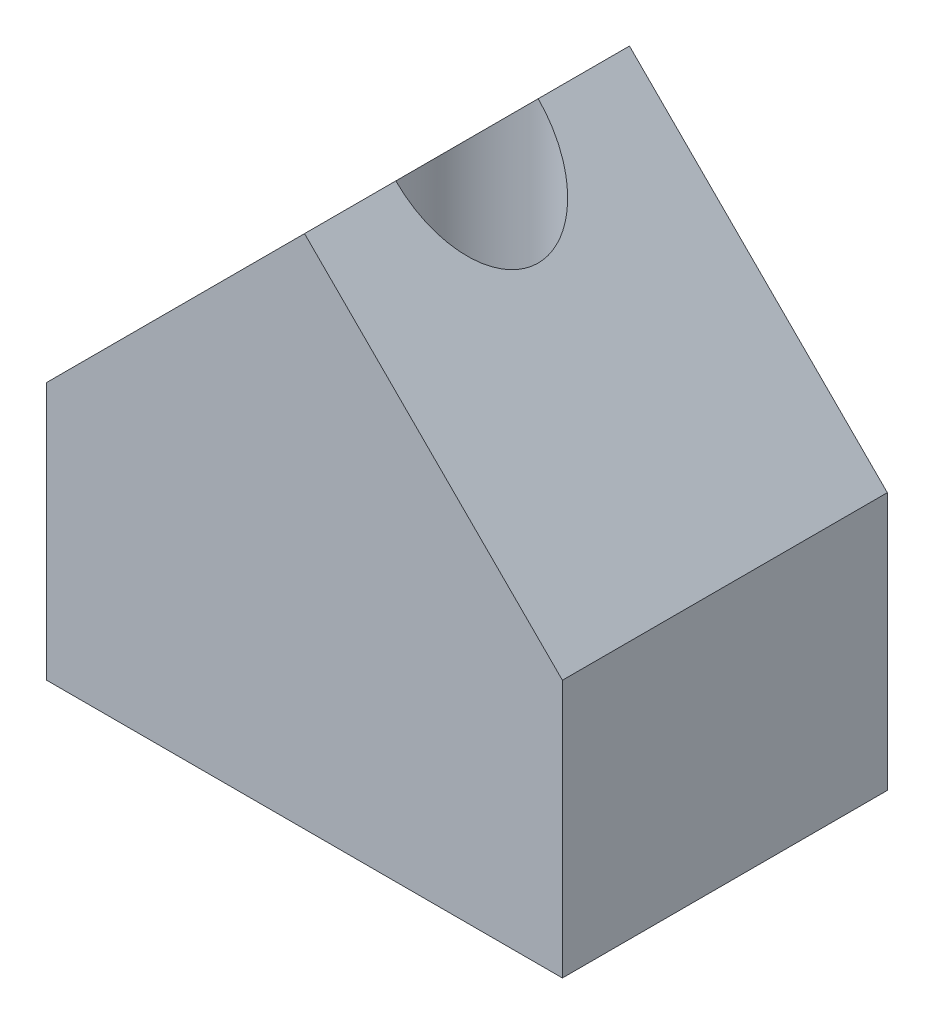
ISO-10303-21;
HEADER;
FILE_DESCRIPTION(('STEP AP214'),'2;1');
FILE_NAME('part.step','',(''),(''),'','','');
FILE_SCHEMA(('AUTOMOTIVE_DESIGN { 1 0 10303 214 1 1 1 1 }'));
ENDSEC;
DATA;
#1=APPLICATION_CONTEXT('core data for automotive mechanical design processes');
#2=APPLICATION_PROTOCOL_DEFINITION('international standard','automotive_design',2000,#1);
#3=PRODUCT_CONTEXT('',#1,'mechanical');
#4=PRODUCT('Part','Part','',(#3));
#5=PRODUCT_RELATED_PRODUCT_CATEGORY('part','',(#4));
#6=PRODUCT_DEFINITION_FORMATION('','',#4);
#7=PRODUCT_DEFINITION_CONTEXT('part definition',#1,'design');
#8=PRODUCT_DEFINITION('design','',#6,#7);
#9=PRODUCT_DEFINITION_SHAPE('','',#8);
#10=(LENGTH_UNIT() NAMED_UNIT(*) SI_UNIT(.MILLI.,.METRE.));
#11=(NAMED_UNIT(*) PLANE_ANGLE_UNIT() SI_UNIT($,.RADIAN.));
#12=(NAMED_UNIT(*) SI_UNIT($,.STERADIAN.) SOLID_ANGLE_UNIT());
#13=UNCERTAINTY_MEASURE_WITH_UNIT(LENGTH_MEASURE(1.E-05),#10,'distance_accuracy_value','');
#14=(GEOMETRIC_REPRESENTATION_CONTEXT(3) GLOBAL_UNCERTAINTY_ASSIGNED_CONTEXT((#13)) GLOBAL_UNIT_ASSIGNED_CONTEXT((#10,
#11,#12)) REPRESENTATION_CONTEXT('',''));
#15=CARTESIAN_POINT('',(0.,0.,0.));
#16=DIRECTION('',(0.,0.,1.));
#17=DIRECTION('',(1.,0.,0.));
#18=AXIS2_PLACEMENT_3D('',#15,#16,#17);
#19=CARTESIAN_POINT('',(3.175,3.17499999999999,8.001));
#20=DIRECTION('',(0.707106781186549,0.707106781186546,0.));
#21=DIRECTION('',(-0.707106781186546,0.707106781186549,0.));
#22=AXIS2_PLACEMENT_3D('',#19,#20,#21);
#23=PLANE('',#22);
#24=CARTESIAN_POINT('',(0.,6.35,4.0005));
#25=DIRECTION('',(0.707106781186549,0.707106781186546,0.));
#26=DIRECTION('',(0.707106781186546,-0.707106781186549,0.));
#27=AXIS2_PLACEMENT_3D('',#24,#25,#26);
#28=ELLIPSE('',#27,2.47855068941509,1.7526);
#29=CARTESIAN_POINT('',(0.,6.35,5.7531));
#30=VERTEX_POINT('',#29);
#31=CARTESIAN_POINT('',(0.,6.35,2.2479));
#32=VERTEX_POINT('',#31);
#33=EDGE_CURVE('E54',#30,#32,#28,.T.);
#34=ORIENTED_EDGE('',*,*,#33,.F.);
#35=DIRECTION('',(0.,0.,-1.));
#36=VECTOR('',#35,1.);
#37=CARTESIAN_POINT('',(0.,6.35,8.001));
#38=LINE('',#37,#36);
#39=CARTESIAN_POINT('',(0.,6.35,8.001));
#40=VERTEX_POINT('',#39);
#41=EDGE_CURVE('E11',#40,#30,#38,.T.);
#42=ORIENTED_EDGE('',*,*,#41,.F.);
#43=DIRECTION('',(0.707106781186546,-0.707106781186549,0.));
#44=VECTOR('',#43,1.);
#45=CARTESIAN_POINT('',(3.175,3.17499999999999,8.001));
#46=LINE('',#45,#44);
#47=CARTESIAN_POINT('',(6.35,0.,8.001));
#48=VERTEX_POINT('',#47);
#49=EDGE_CURVE('E125',#40,#48,#46,.T.);
#50=ORIENTED_EDGE('',*,*,#49,.T.);
#51=DIRECTION('',(0.,0.,-1.));
#52=VECTOR('',#51,1.);
#53=CARTESIAN_POINT('',(6.35,0.,8.001));
#54=LINE('',#53,#52);
#55=CARTESIAN_POINT('',(6.35,0.,0.));
#56=VERTEX_POINT('',#55);
#57=EDGE_CURVE('E87',#48,#56,#54,.T.);
#58=ORIENTED_EDGE('',*,*,#57,.T.);
#59=DIRECTION('',(0.707106781186546,-0.707106781186549,0.));
#60=VECTOR('',#59,1.);
#61=CARTESIAN_POINT('',(3.175,3.17499999999999,0.));
#62=LINE('',#61,#60);
#63=CARTESIAN_POINT('',(0.,6.35,0.));
#64=VERTEX_POINT('',#63);
#65=EDGE_CURVE('E131',#64,#56,#62,.T.);
#66=ORIENTED_EDGE('',*,*,#65,.F.);
#67=EDGE_CURVE('E48',#32,#64,#38,.T.);
#68=ORIENTED_EDGE('',*,*,#67,.F.);
#69=EDGE_LOOP('',(#34,#42,#50,#58,#66,#68));
#70=FACE_BOUND('',#69,.T.);
#71=ADVANCED_FACE('F40',(#70),#23,.T.);
#72=CARTESIAN_POINT('',(-3.175,3.17500000000003,8.001));
#73=DIRECTION('',(0.707106781186544,-0.707106781186551,0.));
#74=DIRECTION('',(0.707106781186551,0.707106781186544,0.));
#75=AXIS2_PLACEMENT_3D('',#72,#73,#74);
#76=PLANE('',#75);
#77=ORIENTED_EDGE('',*,*,#41,.T.);
#78=CARTESIAN_POINT('',(0.,6.35,4.0005));
#79=DIRECTION('',(0.707106781186544,-0.707106781186551,0.));
#80=DIRECTION('',(-0.707106781186551,-0.707106781186544,0.));
#81=AXIS2_PLACEMENT_3D('',#78,#79,#80);
#82=ELLIPSE('',#81,2.47855068941507,1.7526);
#83=EDGE_CURVE('E156',#30,#32,#82,.T.);
#84=ORIENTED_EDGE('',*,*,#83,.T.);
#85=ORIENTED_EDGE('',*,*,#67,.T.);
#86=DIRECTION('',(-0.707106781186551,-0.707106781186544,0.));
#87=VECTOR('',#86,1.);
#88=CARTESIAN_POINT('',(-3.175,3.17500000000003,0.));
#89=LINE('',#88,#87);
#90=CARTESIAN_POINT('',(-6.35,0.,0.));
#91=VERTEX_POINT('',#90);
#92=EDGE_CURVE('E135',#64,#91,#89,.T.);
#93=ORIENTED_EDGE('',*,*,#92,.T.);
#94=DIRECTION('',(0.,0.,-1.));
#95=VECTOR('',#94,1.);
#96=CARTESIAN_POINT('',(-6.35,0.,8.001));
#97=LINE('',#96,#95);
#98=CARTESIAN_POINT('',(-6.35,0.,8.001));
#99=VERTEX_POINT('',#98);
#100=EDGE_CURVE('E110',#99,#91,#97,.T.);
#101=ORIENTED_EDGE('',*,*,#100,.F.);
#102=DIRECTION('',(-0.707106781186551,-0.707106781186544,0.));
#103=VECTOR('',#102,1.);
#104=CARTESIAN_POINT('',(-3.175,3.17500000000003,8.001));
#105=LINE('',#104,#103);
#106=EDGE_CURVE('E120',#40,#99,#105,.T.);
#107=ORIENTED_EDGE('',*,*,#106,.F.);
#108=EDGE_LOOP('',(#77,#84,#85,#93,#101,#107));
#109=FACE_BOUND('',#108,.T.);
#110=ADVANCED_FACE('F155',(#109),#76,.F.);
#111=CARTESIAN_POINT('',(-6.35,0.,8.001));
#112=DIRECTION('',(-1.,0.,0.));
#113=DIRECTION('',(0.,0.,1.));
#114=AXIS2_PLACEMENT_3D('',#111,#112,#113);
#115=PLANE('',#114);
#116=DIRECTION('',(0.,1.,0.));
#117=VECTOR('',#116,1.);
#118=CARTESIAN_POINT('',(-6.35,0.,0.));
#119=LINE('',#118,#117);
#120=CARTESIAN_POINT('',(-6.35,-6.35,0.));
#121=VERTEX_POINT('',#120);
#122=EDGE_CURVE('E106',#121,#91,#119,.T.);
#123=ORIENTED_EDGE('',*,*,#122,.F.);
#124=DIRECTION('',(0.,0.,-1.));
#125=VECTOR('',#124,1.);
#126=CARTESIAN_POINT('',(-6.35,-6.35,8.001));
#127=LINE('',#126,#125);
#128=CARTESIAN_POINT('',(-6.35,-6.35,8.001));
#129=VERTEX_POINT('',#128);
#130=EDGE_CURVE('E100',#129,#121,#127,.T.);
#131=ORIENTED_EDGE('',*,*,#130,.F.);
#132=DIRECTION('',(0.,1.,0.));
#133=VECTOR('',#132,1.);
#134=CARTESIAN_POINT('',(-6.35,0.,8.001));
#135=LINE('',#134,#133);
#136=EDGE_CURVE('E104',#129,#99,#135,.T.);
#137=ORIENTED_EDGE('',*,*,#136,.T.);
#138=ORIENTED_EDGE('',*,*,#100,.T.);
#139=EDGE_LOOP('',(#123,#131,#137,#138));
#140=FACE_BOUND('',#139,.T.);
#141=ADVANCED_FACE('F102',(#140),#115,.T.);
#142=CARTESIAN_POINT('',(0.,-6.35,8.001));
#143=DIRECTION('',(0.,1.,0.));
#144=DIRECTION('',(0.,0.,1.));
#145=AXIS2_PLACEMENT_3D('',#142,#143,#144);
#146=PLANE('',#145);
#147=CARTESIAN_POINT('',(0.,-6.35,4.0005));
#148=DIRECTION('',(0.,-1.,0.));
#149=DIRECTION('',(0.,0.,-1.));
#150=AXIS2_PLACEMENT_3D('',#147,#148,#149);
#151=CIRCLE('',#150,1.7526);
#152=CARTESIAN_POINT('',(0.,-6.35,2.2479));
#153=VERTEX_POINT('',#152);
#154=EDGE_CURVE('E187',#153,#153,#151,.T.);
#155=ORIENTED_EDGE('',*,*,#154,.F.);
#156=EDGE_LOOP('',(#155));
#157=FACE_BOUND('',#156,.T.);
#158=DIRECTION('',(1.,0.,0.));
#159=VECTOR('',#158,1.);
#160=CARTESIAN_POINT('',(0.,-6.35,0.));
#161=LINE('',#160,#159);
#162=CARTESIAN_POINT('',(6.35,-6.35,0.));
#163=VERTEX_POINT('',#162);
#164=EDGE_CURVE('E141',#121,#163,#161,.T.);
#165=ORIENTED_EDGE('',*,*,#164,.T.);
#166=DIRECTION('',(0.,0.,-1.));
#167=VECTOR('',#166,1.);
#168=CARTESIAN_POINT('',(6.35,-6.35,8.001));
#169=LINE('',#168,#167);
#170=CARTESIAN_POINT('',(6.35,-6.35,8.001));
#171=VERTEX_POINT('',#170);
#172=EDGE_CURVE('E111',#171,#163,#169,.T.);
#173=ORIENTED_EDGE('',*,*,#172,.F.);
#174=DIRECTION('',(1.,0.,0.));
#175=VECTOR('',#174,1.);
#176=CARTESIAN_POINT('',(0.,-6.35,8.001));
#177=LINE('',#176,#175);
#178=EDGE_CURVE('E114',#129,#171,#177,.T.);
#179=ORIENTED_EDGE('',*,*,#178,.F.);
#180=ORIENTED_EDGE('',*,*,#130,.T.);
#181=EDGE_LOOP('',(#165,#173,#179,#180));
#182=FACE_BOUND('',#181,.T.);
#183=ADVANCED_FACE('F115',(#157,#182),#146,.F.);
#184=CARTESIAN_POINT('',(6.35,0.,8.001));
#185=DIRECTION('',(-1.,0.,0.));
#186=DIRECTION('',(0.,0.,1.));
#187=AXIS2_PLACEMENT_3D('',#184,#185,#186);
#188=PLANE('',#187);
#189=DIRECTION('',(0.,1.,0.));
#190=VECTOR('',#189,1.);
#191=CARTESIAN_POINT('',(6.35,0.,0.));
#192=LINE('',#191,#190);
#193=EDGE_CURVE('E144',#163,#56,#192,.T.);
#194=ORIENTED_EDGE('',*,*,#193,.T.);
#195=ORIENTED_EDGE('',*,*,#57,.F.);
#196=DIRECTION('',(0.,1.,0.));
#197=VECTOR('',#196,1.);
#198=CARTESIAN_POINT('',(6.35,0.,8.001));
#199=LINE('',#198,#197);
#200=EDGE_CURVE('E63',#171,#48,#199,.T.);
#201=ORIENTED_EDGE('',*,*,#200,.F.);
#202=ORIENTED_EDGE('',*,*,#172,.T.);
#203=EDGE_LOOP('',(#194,#195,#201,#202));
#204=FACE_BOUND('',#203,.T.);
#205=ADVANCED_FACE('F171',(#204),#188,.F.);
#206=CARTESIAN_POINT('',(0.,0.,8.001));
#207=DIRECTION('',(0.,0.,1.));
#208=DIRECTION('',(1.,0.,0.));
#209=AXIS2_PLACEMENT_3D('',#206,#207,#208);
#210=PLANE('',#209);
#211=ORIENTED_EDGE('',*,*,#49,.F.);
#212=ORIENTED_EDGE('',*,*,#106,.T.);
#213=ORIENTED_EDGE('',*,*,#136,.F.);
#214=ORIENTED_EDGE('',*,*,#178,.T.);
#215=ORIENTED_EDGE('',*,*,#200,.T.);
#216=EDGE_LOOP('',(#211,#212,#213,#214,#215));
#217=FACE_BOUND('',#216,.T.);
#218=ADVANCED_FACE('F119',(#217),#210,.T.);
#219=CARTESIAN_POINT('',(0.,0.,0.));
#220=DIRECTION('',(0.,0.,1.));
#221=DIRECTION('',(1.,0.,0.));
#222=AXIS2_PLACEMENT_3D('',#219,#220,#221);
#223=PLANE('',#222);
#224=ORIENTED_EDGE('',*,*,#65,.T.);
#225=ORIENTED_EDGE('',*,*,#193,.F.);
#226=ORIENTED_EDGE('',*,*,#164,.F.);
#227=ORIENTED_EDGE('',*,*,#122,.T.);
#228=ORIENTED_EDGE('',*,*,#92,.F.);
#229=EDGE_LOOP('',(#224,#225,#226,#227,#228));
#230=FACE_BOUND('',#229,.T.);
#231=ADVANCED_FACE('F158',(#230),#223,.F.);
#232=CARTESIAN_POINT('',(0.,6.35,4.0005));
#233=DIRECTION('',(0.,-1.,0.));
#234=DIRECTION('',(0.,0.,-1.));
#235=AXIS2_PLACEMENT_3D('',#232,#233,#234);
#236=CYLINDRICAL_SURFACE('',#235,1.7526);
#237=ORIENTED_EDGE('',*,*,#33,.T.);
#238=ORIENTED_EDGE('',*,*,#83,.F.);
#239=EDGE_LOOP('',(#237,#238));
#240=FACE_BOUND('',#239,.T.);
#241=ORIENTED_EDGE('',*,*,#154,.T.);
#242=EDGE_LOOP('',(#241));
#243=FACE_BOUND('',#242,.T.);
#244=ADVANCED_FACE('F178',(#240,#243),#236,.F.);
#245=CLOSED_SHELL('',(#71,#110,#141,#183,#205,#218,#231,#244));
#246=MANIFOLD_SOLID_BREP('B2',#245);
#247=ADVANCED_BREP_SHAPE_REPRESENTATION('',(#18,#246),#14);
#248=SHAPE_DEFINITION_REPRESENTATION(#9,#247);
ENDSEC;
END-ISO-10303-21;
